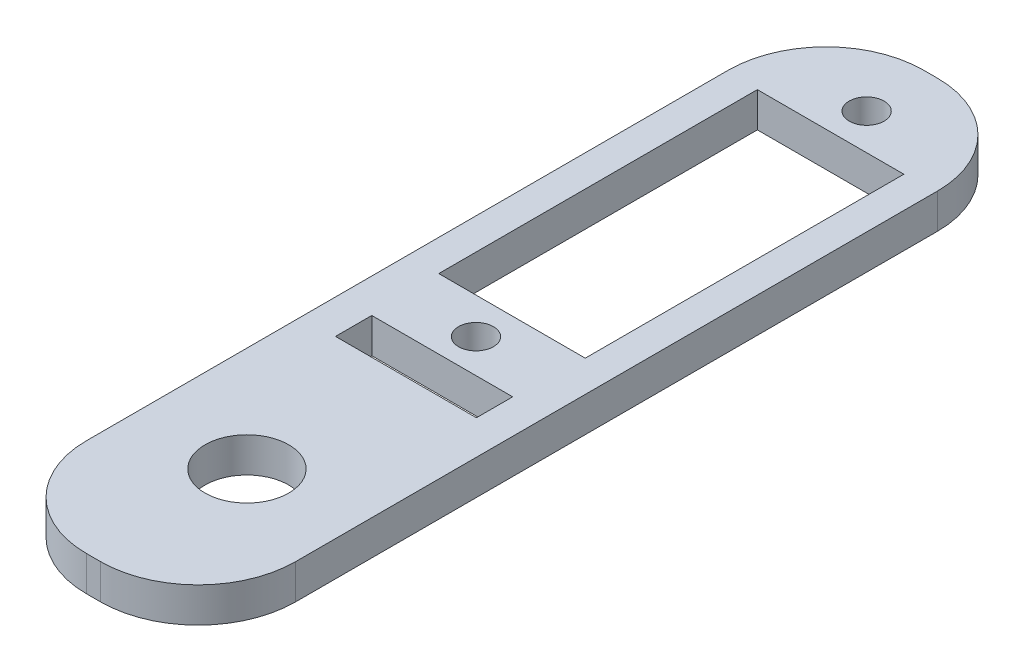
ISO-10303-21;
HEADER;
FILE_DESCRIPTION(('STEP AP214'),'2;1');
FILE_NAME('part.step','',(''),(''),'','','');
FILE_SCHEMA(('AUTOMOTIVE_DESIGN { 1 0 10303 214 1 1 1 1 }'));
ENDSEC;
DATA;
#1=APPLICATION_CONTEXT('core data for automotive mechanical design processes');
#2=APPLICATION_PROTOCOL_DEFINITION('international standard','automotive_design',2000,#1);
#3=PRODUCT_CONTEXT('',#1,'mechanical');
#4=PRODUCT('Part','Part','',(#3));
#5=PRODUCT_RELATED_PRODUCT_CATEGORY('part','',(#4));
#6=PRODUCT_DEFINITION_FORMATION('','',#4);
#7=PRODUCT_DEFINITION_CONTEXT('part definition',#1,'design');
#8=PRODUCT_DEFINITION('design','',#6,#7);
#9=PRODUCT_DEFINITION_SHAPE('','',#8);
#10=(LENGTH_UNIT() NAMED_UNIT(*) SI_UNIT(.MILLI.,.METRE.));
#11=(NAMED_UNIT(*) PLANE_ANGLE_UNIT() SI_UNIT($,.RADIAN.));
#12=(NAMED_UNIT(*) SI_UNIT($,.STERADIAN.) SOLID_ANGLE_UNIT());
#13=UNCERTAINTY_MEASURE_WITH_UNIT(LENGTH_MEASURE(1.E-05),#10,'distance_accuracy_value','');
#14=(GEOMETRIC_REPRESENTATION_CONTEXT(3) GLOBAL_UNCERTAINTY_ASSIGNED_CONTEXT((#13)) GLOBAL_UNIT_ASSIGNED_CONTEXT((#10,
#11,#12)) REPRESENTATION_CONTEXT('',''));
#15=CARTESIAN_POINT('',(0.,0.,0.));
#16=DIRECTION('',(0.,0.,1.));
#17=DIRECTION('',(1.,0.,0.));
#18=AXIS2_PLACEMENT_3D('',#15,#16,#17);
#19=CARTESIAN_POINT('',(-3.3630630745869,19.3987309142265,19.6273983608977));
#20=DIRECTION('',(0.,-1.,0.));
#21=DIRECTION('',(0.,0.,-1.));
#22=AXIS2_PLACEMENT_3D('',#19,#20,#21);
#23=CYLINDRICAL_SURFACE('',#22,8.89);
#24=DIRECTION('',(0.,-1.,0.));
#25=VECTOR('',#24,1.);
#26=CARTESIAN_POINT('',(-3.3630630745869,19.3987309142265,28.5173983608977));
#27=LINE('',#26,#25);
#28=CARTESIAN_POINT('',(-3.3630630745869,19.3987309142265,28.5173983608977));
#29=VERTEX_POINT('',#28);
#30=CARTESIAN_POINT('',(-3.3630630745869,16.2237309142265,28.5173983608977));
#31=VERTEX_POINT('',#30);
#32=EDGE_CURVE('E282',#29,#31,#27,.T.);
#33=ORIENTED_EDGE('',*,*,#32,.F.);
#34=CARTESIAN_POINT('',(-3.3630630745869,19.3987309142265,19.6273983608977));
#35=DIRECTION('',(0.,1.,0.));
#36=DIRECTION('',(0.,0.,1.));
#37=AXIS2_PLACEMENT_3D('',#34,#35,#36);
#38=CIRCLE('',#37,8.89);
#39=CARTESIAN_POINT('',(-12.2530630745869,19.3987309142265,19.6273983608977));
#40=VERTEX_POINT('',#39);
#41=EDGE_CURVE('E40',#40,#29,#38,.T.);
#42=ORIENTED_EDGE('',*,*,#41,.F.);
#43=DIRECTION('',(0.,-1.,0.));
#44=VECTOR('',#43,1.);
#45=CARTESIAN_POINT('',(-12.2530630745869,19.3987309142265,19.6273983608977));
#46=LINE('',#45,#44);
#47=CARTESIAN_POINT('',(-12.2530630745869,16.2237309142265,19.6273983608977));
#48=VERTEX_POINT('',#47);
#49=EDGE_CURVE('E285',#48,#40,#46,.F.);
#50=ORIENTED_EDGE('',*,*,#49,.F.);
#51=CARTESIAN_POINT('',(-3.3630630745869,16.2237309142265,19.6273983608977));
#52=DIRECTION('',(0.,1.,0.));
#53=DIRECTION('',(0.,0.,1.));
#54=AXIS2_PLACEMENT_3D('',#51,#52,#53);
#55=CIRCLE('',#54,8.89);
#56=EDGE_CURVE('E11',#31,#48,#55,.F.);
#57=ORIENTED_EDGE('',*,*,#56,.F.);
#58=EDGE_LOOP('',(#33,#42,#50,#57));
#59=FACE_BOUND('',#58,.T.);
#60=ADVANCED_FACE('F33',(#59),#23,.T.);
#61=CARTESIAN_POINT('',(-2.09306307458689,19.3987309142265,19.6273983608977));
#62=DIRECTION('',(0.,-1.,0.));
#63=DIRECTION('',(0.,0.,-1.));
#64=AXIS2_PLACEMENT_3D('',#61,#62,#63);
#65=CYLINDRICAL_SURFACE('',#64,8.89);
#66=DIRECTION('',(0.,-1.,0.));
#67=VECTOR('',#66,1.);
#68=CARTESIAN_POINT('',(6.79693692541311,19.3987309142265,19.6273983608977));
#69=LINE('',#68,#67);
#70=CARTESIAN_POINT('',(6.79693692541311,19.3987309142265,19.6273983608977));
#71=VERTEX_POINT('',#70);
#72=CARTESIAN_POINT('',(6.79693692541311,16.2237309142265,19.6273983608977));
#73=VERTEX_POINT('',#72);
#74=EDGE_CURVE('E271',#71,#73,#69,.T.);
#75=ORIENTED_EDGE('',*,*,#74,.F.);
#76=CARTESIAN_POINT('',(-2.09306307458689,19.3987309142265,19.6273983608977));
#77=DIRECTION('',(0.,1.,0.));
#78=DIRECTION('',(0.,0.,1.));
#79=AXIS2_PLACEMENT_3D('',#76,#77,#78);
#80=CIRCLE('',#79,8.89);
#81=CARTESIAN_POINT('',(-2.09306307458689,19.3987309142265,28.5173983608977));
#82=VERTEX_POINT('',#81);
#83=EDGE_CURVE('E277',#82,#71,#80,.T.);
#84=ORIENTED_EDGE('',*,*,#83,.F.);
#85=DIRECTION('',(0.,-1.,0.));
#86=VECTOR('',#85,1.);
#87=CARTESIAN_POINT('',(-2.09306307458689,19.3987309142265,28.5173983608977));
#88=LINE('',#87,#86);
#89=CARTESIAN_POINT('',(-2.09306307458689,16.2237309142265,28.5173983608977));
#90=VERTEX_POINT('',#89);
#91=EDGE_CURVE('E274',#90,#82,#88,.F.);
#92=ORIENTED_EDGE('',*,*,#91,.F.);
#93=CARTESIAN_POINT('',(-2.09306307458689,16.2237309142265,19.6273983608977));
#94=DIRECTION('',(0.,1.,0.));
#95=DIRECTION('',(0.,0.,1.));
#96=AXIS2_PLACEMENT_3D('',#93,#94,#95);
#97=CIRCLE('',#96,8.89);
#98=EDGE_CURVE('E279',#73,#90,#97,.F.);
#99=ORIENTED_EDGE('',*,*,#98,.F.);
#100=EDGE_LOOP('',(#75,#84,#92,#99));
#101=FACE_BOUND('',#100,.T.);
#102=ADVANCED_FACE('F296',(#101),#65,.T.);
#103=CARTESIAN_POINT('',(-3.3630630745869,19.3987309142265,-38.7926016391023));
#104=DIRECTION('',(0.,1.,0.));
#105=DIRECTION('',(0.,0.,1.));
#106=AXIS2_PLACEMENT_3D('',#103,#104,#105);
#107=CYLINDRICAL_SURFACE('',#106,8.89);
#108=DIRECTION('',(0.,1.,0.));
#109=VECTOR('',#108,1.);
#110=CARTESIAN_POINT('',(-3.3630630745869,19.3987309142265,-47.6826016391023));
#111=LINE('',#110,#109);
#112=CARTESIAN_POINT('',(-3.3630630745869,16.2237309142265,-47.6826016391023));
#113=VERTEX_POINT('',#112);
#114=CARTESIAN_POINT('',(-3.3630630745869,19.3987309142265,-47.6826016391023));
#115=VERTEX_POINT('',#114);
#116=EDGE_CURVE('E261',#113,#115,#111,.T.);
#117=ORIENTED_EDGE('',*,*,#116,.F.);
#118=CARTESIAN_POINT('',(-3.3630630745869,16.2237309142265,-38.7926016391023));
#119=DIRECTION('',(0.,1.,0.));
#120=DIRECTION('',(0.,0.,1.));
#121=AXIS2_PLACEMENT_3D('',#118,#119,#120);
#122=CIRCLE('',#121,8.89);
#123=CARTESIAN_POINT('',(-12.2530630745869,16.2237309142265,-38.7926016391023));
#124=VERTEX_POINT('',#123);
#125=EDGE_CURVE('E267',#124,#113,#122,.F.);
#126=ORIENTED_EDGE('',*,*,#125,.F.);
#127=DIRECTION('',(0.,1.,0.));
#128=VECTOR('',#127,1.);
#129=CARTESIAN_POINT('',(-12.2530630745869,19.3987309142265,-38.7926016391023));
#130=LINE('',#129,#128);
#131=CARTESIAN_POINT('',(-12.2530630745869,19.3987309142265,-38.7926016391023));
#132=VERTEX_POINT('',#131);
#133=EDGE_CURVE('E264',#132,#124,#130,.F.);
#134=ORIENTED_EDGE('',*,*,#133,.F.);
#135=CARTESIAN_POINT('',(-3.3630630745869,19.3987309142265,-38.7926016391023));
#136=DIRECTION('',(0.,1.,0.));
#137=DIRECTION('',(0.,0.,1.));
#138=AXIS2_PLACEMENT_3D('',#135,#136,#137);
#139=CIRCLE('',#138,8.89);
#140=EDGE_CURVE('E269',#115,#132,#139,.T.);
#141=ORIENTED_EDGE('',*,*,#140,.F.);
#142=EDGE_LOOP('',(#117,#126,#134,#141));
#143=FACE_BOUND('',#142,.T.);
#144=ADVANCED_FACE('F315',(#143),#107,.T.);
#145=CARTESIAN_POINT('',(-2.09306307458689,19.3987309142265,-38.7926016391023));
#146=DIRECTION('',(0.,-1.,0.));
#147=DIRECTION('',(0.,0.,-1.));
#148=AXIS2_PLACEMENT_3D('',#145,#146,#147);
#149=CYLINDRICAL_SURFACE('',#148,8.89);
#150=DIRECTION('',(0.,-1.,0.));
#151=VECTOR('',#150,1.);
#152=CARTESIAN_POINT('',(-2.09306307458689,19.3987309142265,-47.6826016391023));
#153=LINE('',#152,#151);
#154=CARTESIAN_POINT('',(-2.09306307458689,19.3987309142265,-47.6826016391023));
#155=VERTEX_POINT('',#154);
#156=CARTESIAN_POINT('',(-2.09306307458689,16.2237309142265,-47.6826016391023));
#157=VERTEX_POINT('',#156);
#158=EDGE_CURVE('E242',#155,#157,#153,.T.);
#159=ORIENTED_EDGE('',*,*,#158,.F.);
#160=CARTESIAN_POINT('',(-2.09306307458689,19.3987309142265,-38.7926016391023));
#161=DIRECTION('',(0.,1.,0.));
#162=DIRECTION('',(0.,0.,1.));
#163=AXIS2_PLACEMENT_3D('',#160,#161,#162);
#164=CIRCLE('',#163,8.89);
#165=CARTESIAN_POINT('',(6.79693692541311,19.3987309142265,-38.7926016391023));
#166=VERTEX_POINT('',#165);
#167=EDGE_CURVE('E256',#166,#155,#164,.T.);
#168=ORIENTED_EDGE('',*,*,#167,.F.);
#169=DIRECTION('',(0.,-1.,0.));
#170=VECTOR('',#169,1.);
#171=CARTESIAN_POINT('',(6.79693692541311,19.3987309142265,-38.7926016391023));
#172=LINE('',#171,#170);
#173=CARTESIAN_POINT('',(6.79693692541311,16.2237309142265,-38.7926016391023));
#174=VERTEX_POINT('',#173);
#175=EDGE_CURVE('E253',#174,#166,#172,.F.);
#176=ORIENTED_EDGE('',*,*,#175,.F.);
#177=CARTESIAN_POINT('',(-2.09306307458689,16.2237309142265,-38.7926016391023));
#178=DIRECTION('',(0.,1.,0.));
#179=DIRECTION('',(0.,0.,1.));
#180=AXIS2_PLACEMENT_3D('',#177,#178,#179);
#181=CIRCLE('',#180,8.89);
#182=EDGE_CURVE('E258',#157,#174,#181,.F.);
#183=ORIENTED_EDGE('',*,*,#182,.F.);
#184=EDGE_LOOP('',(#159,#168,#176,#183));
#185=FACE_BOUND('',#184,.T.);
#186=ADVANCED_FACE('F303',(#185),#149,.T.);
#187=CARTESIAN_POINT('',(-2.7280630745869,19.3987309142265,-9.58260163910231));
#188=DIRECTION('',(0.,1.,0.));
#189=DIRECTION('',(0.,0.,1.));
#190=AXIS2_PLACEMENT_3D('',#187,#188,#189);
#191=PLANE('',#190);
#192=CARTESIAN_POINT('',(-2.72806307458689,19.3987309142265,14.5473983608977));
#193=DIRECTION('',(0.,1.,0.));
#194=DIRECTION('',(0.,0.,1.));
#195=AXIS2_PLACEMENT_3D('',#192,#193,#194);
#196=CIRCLE('',#195,3.81);
#197=CARTESIAN_POINT('',(-2.72806307458689,19.3987309142265,18.3573983608977));
#198=VERTEX_POINT('',#197);
#199=EDGE_CURVE('E510',#198,#198,#196,.T.);
#200=ORIENTED_EDGE('',*,*,#199,.F.);
#201=EDGE_LOOP('',(#200));
#202=FACE_BOUND('',#201,.T.);
#203=CARTESIAN_POINT('',(-2.7280630745869,19.3987309142265,-6.30260163910231));
#204=DIRECTION('',(0.,1.,0.));
#205=DIRECTION('',(0.,0.,-1.));
#206=AXIS2_PLACEMENT_3D('',#203,#204,#205);
#207=CIRCLE('',#206,1.5875);
#208=CARTESIAN_POINT('',(-2.7280630745869,19.3987309142265,-7.89010163910231));
#209=VERTEX_POINT('',#208);
#210=EDGE_CURVE('E188',#209,#209,#207,.T.);
#211=ORIENTED_EDGE('',*,*,#210,.F.);
#212=EDGE_LOOP('',(#211));
#213=FACE_BOUND('',#212,.T.);
#214=DIRECTION('',(1.,0.,0.));
#215=VECTOR('',#214,1.);
#216=CARTESIAN_POINT('',(-9.39556307458689,19.3987309142265,-9.58260163910231));
#217=LINE('',#216,#215);
#218=CARTESIAN_POINT('',(-9.39556307458689,19.3987309142265,-9.58260163910231));
#219=VERTEX_POINT('',#218);
#220=CARTESIAN_POINT('',(3.9394369254131,19.3987309142265,-9.58260163910231));
#221=VERTEX_POINT('',#220);
#222=EDGE_CURVE('E202',#219,#221,#217,.T.);
#223=ORIENTED_EDGE('',*,*,#222,.F.);
#224=DIRECTION('',(0.,0.,1.));
#225=VECTOR('',#224,1.);
#226=CARTESIAN_POINT('',(-9.39556307458689,19.3987309142265,-38.5826016391023));
#227=LINE('',#226,#225);
#228=CARTESIAN_POINT('',(-9.39556307458689,19.3987309142265,-38.5826016391023));
#229=VERTEX_POINT('',#228);
#230=EDGE_CURVE('E200',#229,#219,#227,.T.);
#231=ORIENTED_EDGE('',*,*,#230,.F.);
#232=DIRECTION('',(-1.,0.,0.));
#233=VECTOR('',#232,1.);
#234=CARTESIAN_POINT('',(-9.39556307458689,19.3987309142265,-38.5826016391023));
#235=LINE('',#234,#233);
#236=CARTESIAN_POINT('',(3.9394369254131,19.3987309142265,-38.5826016391023));
#237=VERTEX_POINT('',#236);
#238=EDGE_CURVE('E208',#237,#229,#235,.T.);
#239=ORIENTED_EDGE('',*,*,#238,.F.);
#240=DIRECTION('',(0.,0.,-1.));
#241=VECTOR('',#240,1.);
#242=CARTESIAN_POINT('',(3.9394369254131,19.3987309142265,-38.5826016391023));
#243=LINE('',#242,#241);
#244=EDGE_CURVE('E205',#221,#237,#243,.T.);
#245=ORIENTED_EDGE('',*,*,#244,.F.);
#246=EDGE_LOOP('',(#223,#231,#239,#245));
#247=FACE_BOUND('',#246,.T.);
#248=DIRECTION('',(0.,0.,1.));
#249=VECTOR('',#248,1.);
#250=CARTESIAN_POINT('',(-12.2530630745869,19.3987309142265,-47.6826016391023));
#251=LINE('',#250,#249);
#252=EDGE_CURVE('E231',#132,#40,#251,.T.);
#253=ORIENTED_EDGE('',*,*,#252,.T.);
#254=ORIENTED_EDGE('',*,*,#41,.T.);
#255=DIRECTION('',(1.,0.,0.));
#256=VECTOR('',#255,1.);
#257=CARTESIAN_POINT('',(-12.2530630745869,19.3987309142265,28.5173983608977));
#258=LINE('',#257,#256);
#259=EDGE_CURVE('E234',#29,#82,#258,.T.);
#260=ORIENTED_EDGE('',*,*,#259,.T.);
#261=ORIENTED_EDGE('',*,*,#83,.T.);
#262=DIRECTION('',(0.,0.,-1.));
#263=VECTOR('',#262,1.);
#264=CARTESIAN_POINT('',(6.79693692541311,19.3987309142265,-47.6826016391023));
#265=LINE('',#264,#263);
#266=EDGE_CURVE('E237',#71,#166,#265,.T.);
#267=ORIENTED_EDGE('',*,*,#266,.T.);
#268=ORIENTED_EDGE('',*,*,#167,.T.);
#269=DIRECTION('',(-1.,0.,0.));
#270=VECTOR('',#269,1.);
#271=CARTESIAN_POINT('',(-12.2530630745869,19.3987309142265,-47.6826016391023));
#272=LINE('',#271,#270);
#273=EDGE_CURVE('E239',#155,#115,#272,.T.);
#274=ORIENTED_EDGE('',*,*,#273,.T.);
#275=ORIENTED_EDGE('',*,*,#140,.T.);
#276=EDGE_LOOP('',(#253,#254,#260,#261,#267,#268,#274,#275));
#277=FACE_BOUND('',#276,.T.);
#278=CARTESIAN_POINT('',(-2.7280630745869,19.3987309142265,-41.8626016391023));
#279=DIRECTION('',(0.,1.,0.));
#280=DIRECTION('',(0.,0.,1.));
#281=AXIS2_PLACEMENT_3D('',#278,#279,#280);
#282=CIRCLE('',#281,1.5875);
#283=CARTESIAN_POINT('',(-2.7280630745869,19.3987309142265,-40.2751016391023));
#284=VERTEX_POINT('',#283);
#285=EDGE_CURVE('E194',#284,#284,#282,.T.);
#286=ORIENTED_EDGE('',*,*,#285,.F.);
#287=EDGE_LOOP('',(#286));
#288=FACE_BOUND('',#287,.T.);
#289=DIRECTION('',(1.,0.,0.));
#290=VECTOR('',#289,1.);
#291=CARTESIAN_POINT('',(-9.1415630745869,19.3987309142265,0.069398360897692));
#292=LINE('',#291,#290);
#293=CARTESIAN_POINT('',(-9.1415630745869,19.3987309142265,0.069398360897692));
#294=VERTEX_POINT('',#293);
#295=CARTESIAN_POINT('',(3.6854369254131,19.3987309142265,0.069398360897692));
#296=VERTEX_POINT('',#295);
#297=EDGE_CURVE('E154',#294,#296,#292,.T.);
#298=ORIENTED_EDGE('',*,*,#297,.F.);
#299=DIRECTION('',(0.,0.,1.));
#300=VECTOR('',#299,1.);
#301=CARTESIAN_POINT('',(-9.14156307458688,19.3987309142265,-3.23260163910231));
#302=LINE('',#301,#300);
#303=CARTESIAN_POINT('',(-9.14156307458688,19.3987309142265,-3.23260163910231));
#304=VERTEX_POINT('',#303);
#305=EDGE_CURVE('E144',#304,#294,#302,.T.);
#306=ORIENTED_EDGE('',*,*,#305,.F.);
#307=DIRECTION('',(-1.,0.,0.));
#308=VECTOR('',#307,1.);
#309=CARTESIAN_POINT('',(-9.14156307458688,19.3987309142265,-3.23260163910231));
#310=LINE('',#309,#308);
#311=CARTESIAN_POINT('',(3.6854369254131,19.3987309142265,-3.23260163910231));
#312=VERTEX_POINT('',#311);
#313=EDGE_CURVE('E170',#312,#304,#310,.T.);
#314=ORIENTED_EDGE('',*,*,#313,.F.);
#315=DIRECTION('',(0.,0.,-1.));
#316=VECTOR('',#315,1.);
#317=CARTESIAN_POINT('',(3.6854369254131,19.3987309142265,-3.23260163910231));
#318=LINE('',#317,#316);
#319=EDGE_CURVE('E168',#296,#312,#318,.T.);
#320=ORIENTED_EDGE('',*,*,#319,.F.);
#321=EDGE_LOOP('',(#298,#306,#314,#320));
#322=FACE_BOUND('',#321,.T.);
#323=ADVANCED_FACE('F166',(#202,#213,#247,#277,#288,#322),#191,.T.);
#324=CARTESIAN_POINT('',(-2.7280630745869,16.2237309142265,-9.58260163910231));
#325=DIRECTION('',(0.,1.,0.));
#326=DIRECTION('',(0.,0.,1.));
#327=AXIS2_PLACEMENT_3D('',#324,#325,#326);
#328=PLANE('',#327);
#329=CARTESIAN_POINT('',(-2.72806307458689,16.2237309142265,14.5473983608977));
#330=DIRECTION('',(0.,1.,0.));
#331=DIRECTION('',(0.,0.,1.));
#332=AXIS2_PLACEMENT_3D('',#329,#330,#331);
#333=CIRCLE('',#332,3.81);
#334=CARTESIAN_POINT('',(-2.72806307458689,16.2237309142265,18.3573983608977));
#335=VERTEX_POINT('',#334);
#336=EDGE_CURVE('E177',#335,#335,#333,.T.);
#337=ORIENTED_EDGE('',*,*,#336,.T.);
#338=EDGE_LOOP('',(#337));
#339=FACE_BOUND('',#338,.T.);
#340=CARTESIAN_POINT('',(-2.7280630745869,16.2237309142265,-6.30260163910231));
#341=DIRECTION('',(0.,1.,0.));
#342=DIRECTION('',(0.,0.,-1.));
#343=AXIS2_PLACEMENT_3D('',#340,#341,#342);
#344=CIRCLE('',#343,1.5875);
#345=CARTESIAN_POINT('',(-2.7280630745869,16.2237309142265,-7.89010163910231));
#346=VERTEX_POINT('',#345);
#347=EDGE_CURVE('E162',#346,#346,#344,.T.);
#348=ORIENTED_EDGE('',*,*,#347,.T.);
#349=EDGE_LOOP('',(#348));
#350=FACE_BOUND('',#349,.T.);
#351=DIRECTION('',(0.,0.,1.));
#352=VECTOR('',#351,1.);
#353=CARTESIAN_POINT('',(-9.39556307458689,16.2237309142265,-38.5826016391023));
#354=LINE('',#353,#352);
#355=CARTESIAN_POINT('',(-9.39556307458689,16.2237309142265,-38.5826016391023));
#356=VERTEX_POINT('',#355);
#357=CARTESIAN_POINT('',(-9.39556307458689,16.2237309142265,-9.58260163910231));
#358=VERTEX_POINT('',#357);
#359=EDGE_CURVE('E197',#356,#358,#354,.T.);
#360=ORIENTED_EDGE('',*,*,#359,.T.);
#361=DIRECTION('',(1.,0.,0.));
#362=VECTOR('',#361,1.);
#363=CARTESIAN_POINT('',(-9.39556307458689,16.2237309142265,-9.58260163910231));
#364=LINE('',#363,#362);
#365=CARTESIAN_POINT('',(3.9394369254131,16.2237309142265,-9.58260163910231));
#366=VERTEX_POINT('',#365);
#367=EDGE_CURVE('E213',#358,#366,#364,.T.);
#368=ORIENTED_EDGE('',*,*,#367,.T.);
#369=DIRECTION('',(0.,0.,-1.));
#370=VECTOR('',#369,1.);
#371=CARTESIAN_POINT('',(3.9394369254131,16.2237309142265,-38.5826016391023));
#372=LINE('',#371,#370);
#373=CARTESIAN_POINT('',(3.9394369254131,16.2237309142265,-38.5826016391023));
#374=VERTEX_POINT('',#373);
#375=EDGE_CURVE('E216',#366,#374,#372,.T.);
#376=ORIENTED_EDGE('',*,*,#375,.T.);
#377=DIRECTION('',(-1.,0.,0.));
#378=VECTOR('',#377,1.);
#379=CARTESIAN_POINT('',(-9.39556307458689,16.2237309142265,-38.5826016391023));
#380=LINE('',#379,#378);
#381=EDGE_CURVE('E203',#374,#356,#380,.T.);
#382=ORIENTED_EDGE('',*,*,#381,.T.);
#383=EDGE_LOOP('',(#360,#368,#376,#382));
#384=FACE_BOUND('',#383,.T.);
#385=DIRECTION('',(1.,0.,0.));
#386=VECTOR('',#385,1.);
#387=CARTESIAN_POINT('',(-12.2530630745869,16.2237309142265,28.5173983608977));
#388=LINE('',#387,#386);
#389=EDGE_CURVE('E245',#31,#90,#388,.T.);
#390=ORIENTED_EDGE('',*,*,#389,.F.);
#391=ORIENTED_EDGE('',*,*,#56,.T.);
#392=DIRECTION('',(0.,0.,1.));
#393=VECTOR('',#392,1.);
#394=CARTESIAN_POINT('',(-12.2530630745869,16.2237309142265,-47.6826016391023));
#395=LINE('',#394,#393);
#396=EDGE_CURVE('E230',#124,#48,#395,.T.);
#397=ORIENTED_EDGE('',*,*,#396,.F.);
#398=ORIENTED_EDGE('',*,*,#125,.T.);
#399=DIRECTION('',(-1.,0.,0.));
#400=VECTOR('',#399,1.);
#401=CARTESIAN_POINT('',(-12.2530630745869,16.2237309142265,-47.6826016391023));
#402=LINE('',#401,#400);
#403=EDGE_CURVE('E235',#157,#113,#402,.T.);
#404=ORIENTED_EDGE('',*,*,#403,.F.);
#405=ORIENTED_EDGE('',*,*,#182,.T.);
#406=DIRECTION('',(0.,0.,-1.));
#407=VECTOR('',#406,1.);
#408=CARTESIAN_POINT('',(6.79693692541311,16.2237309142265,-47.6826016391023));
#409=LINE('',#408,#407);
#410=EDGE_CURVE('E247',#73,#174,#409,.T.);
#411=ORIENTED_EDGE('',*,*,#410,.F.);
#412=ORIENTED_EDGE('',*,*,#98,.T.);
#413=EDGE_LOOP('',(#390,#391,#397,#398,#404,#405,#411,#412));
#414=FACE_BOUND('',#413,.T.);
#415=CARTESIAN_POINT('',(-2.7280630745869,16.2237309142265,-41.8626016391023));
#416=DIRECTION('',(0.,1.,0.));
#417=DIRECTION('',(0.,0.,1.));
#418=AXIS2_PLACEMENT_3D('',#415,#416,#417);
#419=CIRCLE('',#418,1.5875);
#420=CARTESIAN_POINT('',(-2.7280630745869,16.2237309142265,-40.2751016391023));
#421=VERTEX_POINT('',#420);
#422=EDGE_CURVE('E191',#421,#421,#419,.T.);
#423=ORIENTED_EDGE('',*,*,#422,.T.);
#424=EDGE_LOOP('',(#423));
#425=FACE_BOUND('',#424,.T.);
#426=DIRECTION('',(0.,0.,1.));
#427=VECTOR('',#426,1.);
#428=CARTESIAN_POINT('',(-9.14156307458688,16.2237309142265,-3.23260163910231));
#429=LINE('',#428,#427);
#430=CARTESIAN_POINT('',(-9.14156307458688,16.2237309142265,-3.23260163910231));
#431=VERTEX_POINT('',#430);
#432=CARTESIAN_POINT('',(-9.1415630745869,16.2237309142265,0.069398360897692));
#433=VERTEX_POINT('',#432);
#434=EDGE_CURVE('E175',#431,#433,#429,.T.);
#435=ORIENTED_EDGE('',*,*,#434,.T.);
#436=DIRECTION('',(1.,0.,0.));
#437=VECTOR('',#436,1.);
#438=CARTESIAN_POINT('',(-9.1415630745869,16.2237309142265,0.069398360897692));
#439=LINE('',#438,#437);
#440=CARTESIAN_POINT('',(3.6854369254131,16.2237309142265,0.069398360897692));
#441=VERTEX_POINT('',#440);
#442=EDGE_CURVE('E161',#433,#441,#439,.T.);
#443=ORIENTED_EDGE('',*,*,#442,.T.);
#444=DIRECTION('',(0.,0.,-1.));
#445=VECTOR('',#444,1.);
#446=CARTESIAN_POINT('',(3.6854369254131,16.2237309142265,-3.23260163910231));
#447=LINE('',#446,#445);
#448=CARTESIAN_POINT('',(3.6854369254131,16.2237309142265,-3.23260163910231));
#449=VERTEX_POINT('',#448);
#450=EDGE_CURVE('E179',#441,#449,#447,.T.);
#451=ORIENTED_EDGE('',*,*,#450,.T.);
#452=DIRECTION('',(-1.,0.,0.));
#453=VECTOR('',#452,1.);
#454=CARTESIAN_POINT('',(-9.14156307458688,16.2237309142265,-3.23260163910231));
#455=LINE('',#454,#453);
#456=EDGE_CURVE('E155',#449,#431,#455,.T.);
#457=ORIENTED_EDGE('',*,*,#456,.T.);
#458=EDGE_LOOP('',(#435,#443,#451,#457));
#459=FACE_BOUND('',#458,.T.);
#460=ADVANCED_FACE('F308',(#339,#350,#384,#414,#425,#459),#328,.F.);
#461=CARTESIAN_POINT('',(-12.2530630745869,19.3987309142265,-47.6826016391023));
#462=DIRECTION('',(1.,0.,0.));
#463=DIRECTION('',(0.,0.,-1.));
#464=AXIS2_PLACEMENT_3D('',#461,#462,#463);
#465=PLANE('',#464);
#466=ORIENTED_EDGE('',*,*,#396,.T.);
#467=ORIENTED_EDGE('',*,*,#49,.T.);
#468=ORIENTED_EDGE('',*,*,#252,.F.);
#469=ORIENTED_EDGE('',*,*,#133,.T.);
#470=EDGE_LOOP('',(#466,#467,#468,#469));
#471=FACE_BOUND('',#470,.T.);
#472=ADVANCED_FACE('F317',(#471),#465,.F.);
#473=CARTESIAN_POINT('',(-12.2530630745869,19.3987309142265,28.5173983608977));
#474=DIRECTION('',(0.,0.,-1.));
#475=DIRECTION('',(-1.,0.,0.));
#476=AXIS2_PLACEMENT_3D('',#473,#474,#475);
#477=PLANE('',#476);
#478=ORIENTED_EDGE('',*,*,#259,.F.);
#479=ORIENTED_EDGE('',*,*,#32,.T.);
#480=ORIENTED_EDGE('',*,*,#389,.T.);
#481=ORIENTED_EDGE('',*,*,#91,.T.);
#482=EDGE_LOOP('',(#478,#479,#480,#481));
#483=FACE_BOUND('',#482,.T.);
#484=ADVANCED_FACE('F292',(#483),#477,.F.);
#485=CARTESIAN_POINT('',(6.79693692541311,19.3987309142265,-47.6826016391023));
#486=DIRECTION('',(-1.,0.,0.));
#487=DIRECTION('',(0.,0.,1.));
#488=AXIS2_PLACEMENT_3D('',#485,#486,#487);
#489=PLANE('',#488);
#490=ORIENTED_EDGE('',*,*,#266,.F.);
#491=ORIENTED_EDGE('',*,*,#74,.T.);
#492=ORIENTED_EDGE('',*,*,#410,.T.);
#493=ORIENTED_EDGE('',*,*,#175,.T.);
#494=EDGE_LOOP('',(#490,#491,#492,#493));
#495=FACE_BOUND('',#494,.T.);
#496=ADVANCED_FACE('F305',(#495),#489,.F.);
#497=CARTESIAN_POINT('',(-12.2530630745869,19.3987309142265,-47.6826016391023));
#498=DIRECTION('',(0.,0.,1.));
#499=DIRECTION('',(1.,0.,0.));
#500=AXIS2_PLACEMENT_3D('',#497,#498,#499);
#501=PLANE('',#500);
#502=ORIENTED_EDGE('',*,*,#403,.T.);
#503=ORIENTED_EDGE('',*,*,#116,.T.);
#504=ORIENTED_EDGE('',*,*,#273,.F.);
#505=ORIENTED_EDGE('',*,*,#158,.T.);
#506=EDGE_LOOP('',(#502,#503,#504,#505));
#507=FACE_BOUND('',#506,.T.);
#508=ADVANCED_FACE('F311',(#507),#501,.F.);
#509=CARTESIAN_POINT('',(-9.39556307458689,19.3987309142265,-38.5826016391023));
#510=DIRECTION('',(1.,0.,0.));
#511=DIRECTION('',(0.,0.,-1.));
#512=AXIS2_PLACEMENT_3D('',#509,#510,#511);
#513=PLANE('',#512);
#514=ORIENTED_EDGE('',*,*,#359,.F.);
#515=DIRECTION('',(0.,-1.,0.));
#516=VECTOR('',#515,1.);
#517=CARTESIAN_POINT('',(-9.39556307458689,19.3987309142265,-38.5826016391023));
#518=LINE('',#517,#516);
#519=EDGE_CURVE('E210',#229,#356,#518,.T.);
#520=ORIENTED_EDGE('',*,*,#519,.F.);
#521=ORIENTED_EDGE('',*,*,#230,.T.);
#522=DIRECTION('',(0.,-1.,0.));
#523=VECTOR('',#522,1.);
#524=CARTESIAN_POINT('',(-9.39556307458689,19.3987309142265,-9.58260163910231));
#525=LINE('',#524,#523);
#526=EDGE_CURVE('E227',#219,#358,#525,.T.);
#527=ORIENTED_EDGE('',*,*,#526,.T.);
#528=EDGE_LOOP('',(#514,#520,#521,#527));
#529=FACE_BOUND('',#528,.T.);
#530=ADVANCED_FACE('F347',(#529),#513,.T.);
#531=CARTESIAN_POINT('',(-9.39556307458689,19.3987309142265,-9.58260163910231));
#532=DIRECTION('',(0.,0.,-1.));
#533=DIRECTION('',(-1.,0.,0.));
#534=AXIS2_PLACEMENT_3D('',#531,#532,#533);
#535=PLANE('',#534);
#536=ORIENTED_EDGE('',*,*,#367,.F.);
#537=ORIENTED_EDGE('',*,*,#526,.F.);
#538=ORIENTED_EDGE('',*,*,#222,.T.);
#539=DIRECTION('',(0.,-1.,0.));
#540=VECTOR('',#539,1.);
#541=CARTESIAN_POINT('',(3.9394369254131,19.3987309142265,-9.58260163910231));
#542=LINE('',#541,#540);
#543=EDGE_CURVE('E225',#221,#366,#542,.T.);
#544=ORIENTED_EDGE('',*,*,#543,.T.);
#545=EDGE_LOOP('',(#536,#537,#538,#544));
#546=FACE_BOUND('',#545,.T.);
#547=ADVANCED_FACE('F367',(#546),#535,.T.);
#548=CARTESIAN_POINT('',(3.9394369254131,19.3987309142265,-38.5826016391023));
#549=DIRECTION('',(-1.,0.,0.));
#550=DIRECTION('',(0.,0.,1.));
#551=AXIS2_PLACEMENT_3D('',#548,#549,#550);
#552=PLANE('',#551);
#553=ORIENTED_EDGE('',*,*,#375,.F.);
#554=ORIENTED_EDGE('',*,*,#543,.F.);
#555=ORIENTED_EDGE('',*,*,#244,.T.);
#556=DIRECTION('',(0.,-1.,0.));
#557=VECTOR('',#556,1.);
#558=CARTESIAN_POINT('',(3.9394369254131,19.3987309142265,-38.5826016391023));
#559=LINE('',#558,#557);
#560=EDGE_CURVE('E223',#237,#374,#559,.T.);
#561=ORIENTED_EDGE('',*,*,#560,.T.);
#562=EDGE_LOOP('',(#553,#554,#555,#561));
#563=FACE_BOUND('',#562,.T.);
#564=ADVANCED_FACE('F374',(#563),#552,.T.);
#565=CARTESIAN_POINT('',(-9.39556307458689,19.3987309142265,-38.5826016391023));
#566=DIRECTION('',(0.,0.,1.));
#567=DIRECTION('',(1.,0.,0.));
#568=AXIS2_PLACEMENT_3D('',#565,#566,#567);
#569=PLANE('',#568);
#570=ORIENTED_EDGE('',*,*,#381,.F.);
#571=ORIENTED_EDGE('',*,*,#560,.F.);
#572=ORIENTED_EDGE('',*,*,#238,.T.);
#573=ORIENTED_EDGE('',*,*,#519,.T.);
#574=EDGE_LOOP('',(#570,#571,#572,#573));
#575=FACE_BOUND('',#574,.T.);
#576=ADVANCED_FACE('F381',(#575),#569,.T.);
#577=CARTESIAN_POINT('',(-2.7280630745869,19.3987309142265,-41.8626016391023));
#578=DIRECTION('',(0.,-1.,0.));
#579=DIRECTION('',(0.,0.,-1.));
#580=AXIS2_PLACEMENT_3D('',#577,#578,#579);
#581=CYLINDRICAL_SURFACE('',#580,1.5875);
#582=ORIENTED_EDGE('',*,*,#285,.T.);
#583=EDGE_LOOP('',(#582));
#584=FACE_BOUND('',#583,.T.);
#585=ORIENTED_EDGE('',*,*,#422,.F.);
#586=EDGE_LOOP('',(#585));
#587=FACE_BOUND('',#586,.T.);
#588=ADVANCED_FACE('F389',(#584,#587),#581,.F.);
#589=CARTESIAN_POINT('',(-2.7280630745869,19.3987309142265,-6.30260163910231));
#590=DIRECTION('',(0.,-1.,0.));
#591=DIRECTION('',(0.,0.,-1.));
#592=AXIS2_PLACEMENT_3D('',#589,#590,#591);
#593=CYLINDRICAL_SURFACE('',#592,1.5875);
#594=ORIENTED_EDGE('',*,*,#210,.T.);
#595=EDGE_LOOP('',(#594));
#596=FACE_BOUND('',#595,.T.);
#597=ORIENTED_EDGE('',*,*,#347,.F.);
#598=EDGE_LOOP('',(#597));
#599=FACE_BOUND('',#598,.T.);
#600=ADVANCED_FACE('F397',(#596,#599),#593,.F.);
#601=CARTESIAN_POINT('',(-9.14156307458688,19.3987309142265,-3.23260163910231));
#602=DIRECTION('',(1.,0.,0.));
#603=DIRECTION('',(0.,0.,-1.));
#604=AXIS2_PLACEMENT_3D('',#601,#602,#603);
#605=PLANE('',#604);
#606=ORIENTED_EDGE('',*,*,#434,.F.);
#607=DIRECTION('',(0.,-1.,0.));
#608=VECTOR('',#607,1.);
#609=CARTESIAN_POINT('',(-9.14156307458688,19.3987309142265,-3.23260163910231));
#610=LINE('',#609,#608);
#611=EDGE_CURVE('E150',#304,#431,#610,.T.);
#612=ORIENTED_EDGE('',*,*,#611,.F.);
#613=ORIENTED_EDGE('',*,*,#305,.T.);
#614=DIRECTION('',(0.,-1.,0.));
#615=VECTOR('',#614,1.);
#616=CARTESIAN_POINT('',(-9.1415630745869,19.3987309142265,0.069398360897692));
#617=LINE('',#616,#615);
#618=EDGE_CURVE('E147',#294,#433,#617,.T.);
#619=ORIENTED_EDGE('',*,*,#618,.T.);
#620=EDGE_LOOP('',(#606,#612,#613,#619));
#621=FACE_BOUND('',#620,.T.);
#622=ADVANCED_FACE('F146',(#621),#605,.T.);
#623=CARTESIAN_POINT('',(-9.1415630745869,19.3987309142265,0.069398360897692));
#624=DIRECTION('',(0.,0.,-1.));
#625=DIRECTION('',(-1.,0.,0.));
#626=AXIS2_PLACEMENT_3D('',#623,#624,#625);
#627=PLANE('',#626);
#628=ORIENTED_EDGE('',*,*,#442,.F.);
#629=ORIENTED_EDGE('',*,*,#618,.F.);
#630=ORIENTED_EDGE('',*,*,#297,.T.);
#631=DIRECTION('',(0.,-1.,0.));
#632=VECTOR('',#631,1.);
#633=CARTESIAN_POINT('',(3.6854369254131,19.3987309142265,0.069398360897692));
#634=LINE('',#633,#632);
#635=EDGE_CURVE('E163',#296,#441,#634,.T.);
#636=ORIENTED_EDGE('',*,*,#635,.T.);
#637=EDGE_LOOP('',(#628,#629,#630,#636));
#638=FACE_BOUND('',#637,.T.);
#639=ADVANCED_FACE('F158',(#638),#627,.T.);
#640=CARTESIAN_POINT('',(3.6854369254131,19.3987309142265,-3.23260163910231));
#641=DIRECTION('',(-1.,0.,0.));
#642=DIRECTION('',(0.,0.,1.));
#643=AXIS2_PLACEMENT_3D('',#640,#641,#642);
#644=PLANE('',#643);
#645=ORIENTED_EDGE('',*,*,#450,.F.);
#646=ORIENTED_EDGE('',*,*,#635,.F.);
#647=ORIENTED_EDGE('',*,*,#319,.T.);
#648=DIRECTION('',(0.,-1.,0.));
#649=VECTOR('',#648,1.);
#650=CARTESIAN_POINT('',(3.6854369254131,19.3987309142265,-3.23260163910231));
#651=LINE('',#650,#649);
#652=EDGE_CURVE('E185',#312,#449,#651,.T.);
#653=ORIENTED_EDGE('',*,*,#652,.T.);
#654=EDGE_LOOP('',(#645,#646,#647,#653));
#655=FACE_BOUND('',#654,.T.);
#656=ADVANCED_FACE('F418',(#655),#644,.T.);
#657=CARTESIAN_POINT('',(-9.14156307458688,19.3987309142265,-3.23260163910231));
#658=DIRECTION('',(0.,0.,1.));
#659=DIRECTION('',(1.,0.,0.));
#660=AXIS2_PLACEMENT_3D('',#657,#658,#659);
#661=PLANE('',#660);
#662=ORIENTED_EDGE('',*,*,#456,.F.);
#663=ORIENTED_EDGE('',*,*,#652,.F.);
#664=ORIENTED_EDGE('',*,*,#313,.T.);
#665=ORIENTED_EDGE('',*,*,#611,.T.);
#666=EDGE_LOOP('',(#662,#663,#664,#665));
#667=FACE_BOUND('',#666,.T.);
#668=ADVANCED_FACE('F425',(#667),#661,.T.);
#669=CARTESIAN_POINT('',(-2.72806307458689,16.2237309142265,14.5473983608977));
#670=DIRECTION('',(0.,1.,0.));
#671=DIRECTION('',(0.,0.,1.));
#672=AXIS2_PLACEMENT_3D('',#669,#670,#671);
#673=CYLINDRICAL_SURFACE('',#672,3.81);
#674=ORIENTED_EDGE('',*,*,#336,.F.);
#675=EDGE_LOOP('',(#674));
#676=FACE_BOUND('',#675,.T.);
#677=ORIENTED_EDGE('',*,*,#199,.T.);
#678=EDGE_LOOP('',(#677));
#679=FACE_BOUND('',#678,.T.);
#680=ADVANCED_FACE('F433',(#676,#679),#673,.F.);
#681=CLOSED_SHELL('',(#60,#102,#144,#186,#323,#460,#472,#484,#496,#508,#530,#547,#564,#576,#588,
#600,#622,#639,#656,#668,#680));
#682=MANIFOLD_SOLID_BREP('B2',#681);
#683=ADVANCED_BREP_SHAPE_REPRESENTATION('',(#18,#682),#14);
#684=SHAPE_DEFINITION_REPRESENTATION(#9,#683);
ENDSEC;
END-ISO-10303-21;
